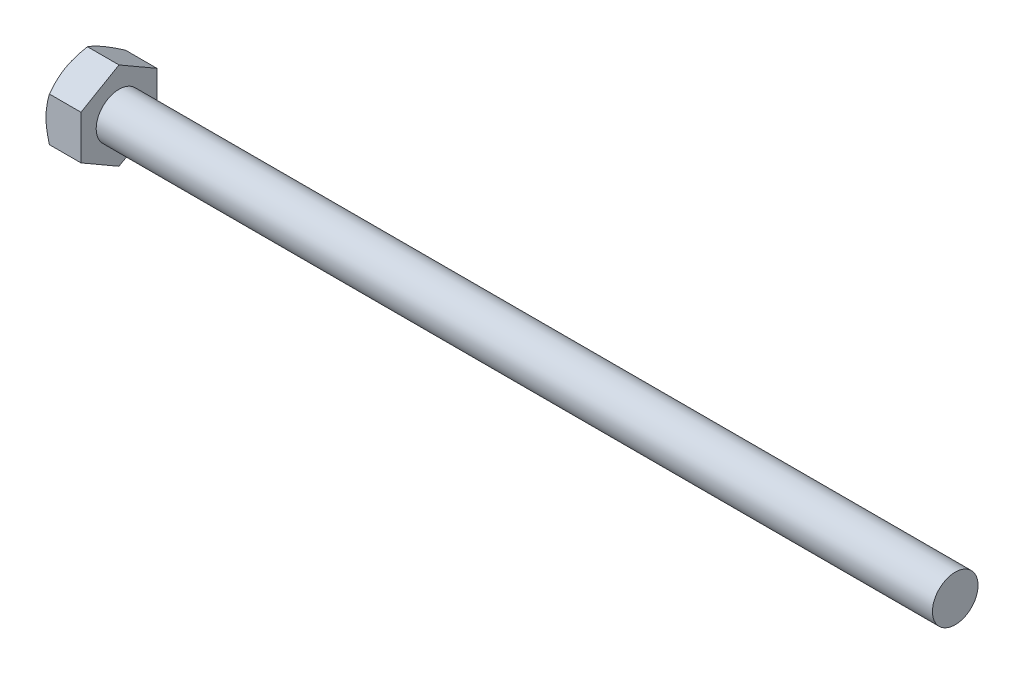
ISO-10303-21;
HEADER;
FILE_DESCRIPTION(('STEP AP214'),'2;1');
FILE_NAME('part.step','',(''),(''),'','','');
FILE_SCHEMA(('AUTOMOTIVE_DESIGN { 1 0 10303 214 1 1 1 1 }'));
ENDSEC;
DATA;
#1=APPLICATION_CONTEXT('core data for automotive mechanical design processes');
#2=APPLICATION_PROTOCOL_DEFINITION('international standard','automotive_design',2000,#1);
#3=PRODUCT_CONTEXT('',#1,'mechanical');
#4=PRODUCT('Part','Part','',(#3));
#5=PRODUCT_RELATED_PRODUCT_CATEGORY('part','',(#4));
#6=PRODUCT_DEFINITION_FORMATION('','',#4);
#7=PRODUCT_DEFINITION_CONTEXT('part definition',#1,'design');
#8=PRODUCT_DEFINITION('design','',#6,#7);
#9=PRODUCT_DEFINITION_SHAPE('','',#8);
#10=(LENGTH_UNIT() NAMED_UNIT(*) SI_UNIT(.MILLI.,.METRE.));
#11=(NAMED_UNIT(*) PLANE_ANGLE_UNIT() SI_UNIT($,.RADIAN.));
#12=(NAMED_UNIT(*) SI_UNIT($,.STERADIAN.) SOLID_ANGLE_UNIT());
#13=UNCERTAINTY_MEASURE_WITH_UNIT(LENGTH_MEASURE(1.E-05),#10,'distance_accuracy_value','');
#14=(GEOMETRIC_REPRESENTATION_CONTEXT(3) GLOBAL_UNCERTAINTY_ASSIGNED_CONTEXT((#13)) GLOBAL_UNIT_ASSIGNED_CONTEXT((#10,
#11,#12)) REPRESENTATION_CONTEXT('',''));
#15=CARTESIAN_POINT('',(0.,0.,0.));
#16=DIRECTION('',(0.,0.,1.));
#17=DIRECTION('',(1.,0.,0.));
#18=AXIS2_PLACEMENT_3D('',#15,#16,#17);
#19=CARTESIAN_POINT('',(2.3,1.5,0.));
#20=DIRECTION('',(-1.,0.,0.));
#21=DIRECTION('',(0.,0.,1.));
#22=AXIS2_PLACEMENT_3D('',#19,#20,#21);
#23=PLANE('',#22);
#24=CARTESIAN_POINT('',(2.3,0.,0.));
#25=DIRECTION('',(-1.,0.,0.));
#26=DIRECTION('',(0.,0.,1.));
#27=AXIS2_PLACEMENT_3D('',#24,#25,#26);
#28=CIRCLE('',#27,1.5);
#29=CARTESIAN_POINT('',(2.3,0.,1.5));
#30=VERTEX_POINT('',#29);
#31=EDGE_CURVE('E200',#30,#30,#28,.T.);
#32=ORIENTED_EDGE('',*,*,#31,.T.);
#33=EDGE_LOOP('',(#32));
#34=FACE_BOUND('',#33,.T.);
#35=DIRECTION('',(0.,1.,0.));
#36=VECTOR('',#35,1.);
#37=CARTESIAN_POINT('',(2.3,-1.44337567928133,2.5));
#38=LINE('',#37,#36);
#39=CARTESIAN_POINT('',(2.3,-1.44337567928133,2.5));
#40=VERTEX_POINT('',#39);
#41=CARTESIAN_POINT('',(2.3,1.44337567928159,2.5));
#42=VERTEX_POINT('',#41);
#43=EDGE_CURVE('E60',#40,#42,#38,.T.);
#44=ORIENTED_EDGE('',*,*,#43,.F.);
#45=DIRECTION('',(0.,0.50000000163871,0.866025402838329));
#46=VECTOR('',#45,1.);
#47=CARTESIAN_POINT('',(2.3,-2.8867513585628,0.));
#48=LINE('',#47,#46);
#49=CARTESIAN_POINT('',(2.3,-2.8867513585628,0.));
#50=VERTEX_POINT('',#49);
#51=EDGE_CURVE('E133',#50,#40,#48,.T.);
#52=ORIENTED_EDGE('',*,*,#51,.F.);
#53=DIRECTION('',(0.,-0.50000000163871,0.866025402838329));
#54=VECTOR('',#53,1.);
#55=CARTESIAN_POINT('',(2.3,-1.44337567928133,-2.5));
#56=LINE('',#55,#54);
#57=CARTESIAN_POINT('',(2.3,-1.44337567928133,-2.5));
#58=VERTEX_POINT('',#57);
#59=EDGE_CURVE('E131',#58,#50,#56,.T.);
#60=ORIENTED_EDGE('',*,*,#59,.F.);
#61=DIRECTION('',(0.,-1.,0.));
#62=VECTOR('',#61,1.);
#63=CARTESIAN_POINT('',(2.3,1.44337567928159,-2.5));
#64=LINE('',#63,#62);
#65=CARTESIAN_POINT('',(2.3,1.44337567928159,-2.5));
#66=VERTEX_POINT('',#65);
#67=EDGE_CURVE('E114',#66,#58,#64,.T.);
#68=ORIENTED_EDGE('',*,*,#67,.F.);
#69=DIRECTION('',(0.,-0.50000000163871,-0.866025402838329));
#70=VECTOR('',#69,1.);
#71=CARTESIAN_POINT('',(2.3,2.88675135856305,0.));
#72=LINE('',#71,#70);
#73=CARTESIAN_POINT('',(2.3,2.88675135856305,0.));
#74=VERTEX_POINT('',#73);
#75=EDGE_CURVE('E123',#74,#66,#72,.T.);
#76=ORIENTED_EDGE('',*,*,#75,.F.);
#77=DIRECTION('',(0.,0.50000000163871,-0.866025402838329));
#78=VECTOR('',#77,1.);
#79=CARTESIAN_POINT('',(2.3,1.44337567928159,2.5));
#80=LINE('',#79,#78);
#81=EDGE_CURVE('E127',#42,#74,#80,.T.);
#82=ORIENTED_EDGE('',*,*,#81,.F.);
#83=EDGE_LOOP('',(#44,#52,#60,#68,#76,#82));
#84=FACE_BOUND('',#83,.T.);
#85=ADVANCED_FACE('F37',(#34,#84),#23,.F.);
#86=CARTESIAN_POINT('',(-25.4,0.,0.));
#87=DIRECTION('',(-1.,0.,0.));
#88=DIRECTION('',(0.,0.,1.));
#89=AXIS2_PLACEMENT_3D('',#86,#87,#88);
#90=CYLINDRICAL_SURFACE('',#89,1.5);
#91=CARTESIAN_POINT('',(57.3,0.,0.));
#92=DIRECTION('',(-1.,0.,0.));
#93=DIRECTION('',(0.,0.,1.));
#94=AXIS2_PLACEMENT_3D('',#91,#92,#93);
#95=CIRCLE('',#94,1.5);
#96=CARTESIAN_POINT('',(57.3,0.,1.5));
#97=VERTEX_POINT('',#96);
#98=EDGE_CURVE('E11',#97,#97,#95,.T.);
#99=ORIENTED_EDGE('',*,*,#98,.T.);
#100=EDGE_LOOP('',(#99));
#101=FACE_BOUND('',#100,.T.);
#102=ORIENTED_EDGE('',*,*,#31,.F.);
#103=EDGE_LOOP('',(#102));
#104=FACE_BOUND('',#103,.T.);
#105=ADVANCED_FACE('F39',(#101,#104),#90,.T.);
#106=CARTESIAN_POINT('',(57.3,1.5,0.));
#107=DIRECTION('',(1.,0.,0.));
#108=DIRECTION('',(0.,0.,-1.));
#109=AXIS2_PLACEMENT_3D('',#106,#107,#108);
#110=PLANE('',#109);
#111=ORIENTED_EDGE('',*,*,#98,.F.);
#112=EDGE_LOOP('',(#111));
#113=FACE_BOUND('',#112,.T.);
#114=ADVANCED_FACE('F181',(#113),#110,.T.);
#115=CARTESIAN_POINT('',(2.3,-1.44337567928133,2.5));
#116=DIRECTION('',(0.,0.,1.));
#117=DIRECTION('',(0.,-1.,0.));
#118=AXIS2_PLACEMENT_3D('',#115,#116,#117);
#119=PLANE('',#118);
#120=DIRECTION('',(-1.,0.,0.));
#121=VECTOR('',#120,1.);
#122=CARTESIAN_POINT('',(2.3,-1.44337567928133,2.5));
#123=LINE('',#122,#121);
#124=CARTESIAN_POINT('',(0.223290995513354,-1.44337567928133,2.5));
#125=VERTEX_POINT('',#124);
#126=EDGE_CURVE('E140',#40,#125,#123,.T.);
#127=ORIENTED_EDGE('',*,*,#126,.F.);
#128=ORIENTED_EDGE('',*,*,#43,.T.);
#129=DIRECTION('',(-1.,0.,0.));
#130=VECTOR('',#129,1.);
#131=CARTESIAN_POINT('',(2.3,1.44337567928159,2.5));
#132=LINE('',#131,#130);
#133=CARTESIAN_POINT('',(0.223290995513429,1.44337567928159,2.5));
#134=VERTEX_POINT('',#133);
#135=EDGE_CURVE('E139',#42,#134,#132,.T.);
#136=ORIENTED_EDGE('',*,*,#135,.T.);
#137=CARTESIAN_POINT('',(1.19632004406595,-3.82805178069449,2.5));
#138=CARTESIAN_POINT('',(1.14327589629636,-3.7182875906123,2.5));
#139=CARTESIAN_POINT('',(1.09075904917703,-3.60826388251005,2.5));
#140=CARTESIAN_POINT('',(0.987081273872628,-3.38755710903453,2.5));
#141=CARTESIAN_POINT('',(0.935920580448254,-3.27687393351173,2.5));
#142=CARTESIAN_POINT('',(0.834986914311904,-3.05411000573681,2.5));
#143=CARTESIAN_POINT('',(0.785223558317014,-2.94202488038616,2.5));
#144=CARTESIAN_POINT('',(0.687834293242499,-2.71693339089507,2.5));
#145=CARTESIAN_POINT('',(0.64020827274816,-2.60392707513802,2.5));
#146=CARTESIAN_POINT('',(0.547096599216495,-2.37541055612811,2.5));
#147=CARTESIAN_POINT('',(0.501644402476205,-2.25988664554279,2.5));
#148=CARTESIAN_POINT('',(0.414299798759198,-2.02747621227372,2.5));
#149=CARTESIAN_POINT('',(0.372407787833691,-1.91058953963062,2.5));
#150=CARTESIAN_POINT('',(0.293309177636011,-1.67550769213624,2.5));
#151=CARTESIAN_POINT('',(0.25609261725792,-1.55731590352552,2.5));
#152=CARTESIAN_POINT('',(0.187553577101156,-1.31925207497197,2.5));
#153=CARTESIAN_POINT('',(0.156229233411223,-1.19938057931484,2.5));
#154=CARTESIAN_POINT('',(0.100995335359192,-0.957875466950475,2.5));
#155=CARTESIAN_POINT('',(0.0770877549190804,-0.836241390144261,2.5));
#156=CARTESIAN_POINT('',(0.0382970673549973,-0.591506739851933,2.5));
#157=CARTESIAN_POINT('',(0.0234139682023207,-0.468406165070562,2.5));
#158=CARTESIAN_POINT('',(0.00398887707067176,-0.222162283708564,2.5));
#159=CARTESIAN_POINT('',(-0.000618582954530851,-0.0990242760150258,2.5));
#160=CARTESIAN_POINT('',(0.000752385125691248,0.147165525321938,2.5));
#161=CARTESIAN_POINT('',(0.00672806531326748,0.270217333048273,2.5));
#162=CARTESIAN_POINT('',(0.0255487226845901,0.480345911839685,2.5));
#163=CARTESIAN_POINT('',(0.0359427194182765,0.567654504214298,2.5));
#164=CARTESIAN_POINT('',(0.0613825749513618,0.741597260879313,2.5));
#165=CARTESIAN_POINT('',(0.0764291673933814,0.828231316595431,2.5));
#166=CARTESIAN_POINT('',(0.127758160854863,1.0870510539617,2.5));
#167=CARTESIAN_POINT('',(0.170216562336702,1.258023566365,2.5));
#168=CARTESIAN_POINT('',(0.243445888381077,1.51385794210056,2.5));
#169=CARTESIAN_POINT('',(0.269819264012639,1.60005333907683,2.5));
#170=CARTESIAN_POINT('',(0.325175689355996,1.7715444847852,2.5));
#171=CARTESIAN_POINT('',(0.354156939094442,1.8568408093229,2.5));
#172=CARTESIAN_POINT('',(0.414126062328043,2.02617712827433,2.5));
#173=CARTESIAN_POINT('',(0.445101723039576,2.11022149180121,2.5));
#174=CARTESIAN_POINT('',(0.508871156887617,2.27765814571535,2.5));
#175=CARTESIAN_POINT('',(0.541665664837585,2.36105015679791,2.5));
#176=CARTESIAN_POINT('',(0.575190110848553,2.44414064056434,2.5));
#177=B_SPLINE_CURVE_WITH_KNOTS('',3,(#137,#138,#139,#140,#141,#142,#143,#144,#145,#146,#147,
#148,#149,#150,#151,#152,#153,#154,#155,#156,#157,#158,#159,#160,#161,#162,#163,#164,#165,#166,
#167,#168,#169,#170,#171,#172,#173,#174,#175,#176),.UNSPECIFIED.,.F.,.F.,(4,2,2,2,2,2,2,2,2,2,2,
2,2,2,2,2,2,2,2,4),(0.,0.365732583178816,0.731528069426235,1.0994168436567,1.46728641830588,
1.83967239293614,2.21209973939173,2.58371966044213,2.95522182687511,3.32682278147237,
3.69842406430308,4.06765095845392,4.43678199670504,4.70042859172476,4.96411678096691,
5.49188560395094,5.76228383952689,6.03249685521827,6.30118893346184,6.56999036530353),.UNSPECIFIED.);
#178=CARTESIAN_POINT('',(0.,0.,2.5));
#179=VERTEX_POINT('',#178);
#180=EDGE_CURVE('E183',#179,#134,#177,.T.);
#181=ORIENTED_EDGE('',*,*,#180,.F.);
#182=EDGE_CURVE('E191',#125,#179,#177,.T.);
#183=ORIENTED_EDGE('',*,*,#182,.F.);
#184=EDGE_LOOP('',(#127,#128,#136,#181,#183));
#185=FACE_BOUND('',#184,.T.);
#186=ADVANCED_FACE('F177',(#185),#119,.T.);
#187=CARTESIAN_POINT('',(2.3,-2.8867513585628,0.));
#188=DIRECTION('',(0.,-0.866025402838329,0.500000001638711));
#189=DIRECTION('',(0.,-0.500000001638711,-0.866025402838329));
#190=AXIS2_PLACEMENT_3D('',#187,#188,#189);
#191=PLANE('',#190);
#192=DIRECTION('',(-1.,0.,0.));
#193=VECTOR('',#192,1.);
#194=CARTESIAN_POINT('',(2.3,-2.8867513585628,0.));
#195=LINE('',#194,#193);
#196=CARTESIAN_POINT('',(0.223291000975683,-2.8867513585628,0.));
#197=VERTEX_POINT('',#196);
#198=EDGE_CURVE('E144',#50,#197,#195,.T.);
#199=ORIENTED_EDGE('',*,*,#198,.F.);
#200=ORIENTED_EDGE('',*,*,#51,.T.);
#201=ORIENTED_EDGE('',*,*,#126,.T.);
#202=CARTESIAN_POINT('',(0.223357671642481,-2.88686682861714,-0.000199999999997055));
#203=CARTESIAN_POINT('',(0.186721627123144,-2.823437260003,0.109663235061774));
#204=CARTESIAN_POINT('',(0.153402225713998,-2.75946017255779,0.220474800552927));
#205=CARTESIAN_POINT('',(0.0952422917887059,-2.63039811834957,0.444016834793913));
#206=CARTESIAN_POINT('',(0.0704223351272887,-2.5653108579734,0.556751276198274));
#207=CARTESIAN_POINT('',(0.0317856569546165,-2.43594298952786,0.780822996233662));
#208=CARTESIAN_POINT('',(0.0177118014837245,-2.37168228872263,0.892125794471919));
#209=CARTESIAN_POINT('',(0.000909157269638142,-2.24285844798616,1.1152552308786));
#210=CARTESIAN_POINT('',(-0.0018335440453357,-2.17829577643781,1.22708105778404));
#211=CARTESIAN_POINT('',(0.00386576449219316,-2.05765213161006,1.43604197932287));
#212=CARTESIAN_POINT('',(0.0109083986955485,-2.00155311785805,1.53320832097125));
#213=CARTESIAN_POINT('',(0.0332314230427739,-1.88972058300822,1.72690795242393));
#214=CARTESIAN_POINT('',(0.0485194421325141,-1.83398744884957,1.82344057202992));
#215=CARTESIAN_POINT('',(0.0867390970453044,-1.7219242510559,2.01753972341901));
#216=CARTESIAN_POINT('',(0.109832779058663,-1.66560837412358,2.11508168311234));
#217=CARTESIAN_POINT('',(0.162246658960904,-1.55381666130744,2.3087106087289));
#218=CARTESIAN_POINT('',(0.191554537725398,-1.49833939269559,2.40480005620986));
#219=CARTESIAN_POINT('',(0.223357666179496,-1.44326020922699,2.5002));
#220=B_SPLINE_CURVE_WITH_KNOTS('',3,(#202,#203,#204,#205,#206,#207,#208,#209,#210,#211,#212,
#213,#214,#215,#216,#217,#218,#219),.UNSPECIFIED.,.F.,.F.,(4,2,2,2,2,2,2,2,4),(0.,
0.396285829073731,0.793524333587547,1.18093087363639,1.56786160813528,1.90479742383017,
2.24204552159359,2.58677531937551,2.93082800409491),.UNSPECIFIED.);
#221=CARTESIAN_POINT('',(0.,-2.16506351419155,1.2500000081935));
#222=VERTEX_POINT('',#221);
#223=EDGE_CURVE('E193',#222,#125,#220,.T.);
#224=ORIENTED_EDGE('',*,*,#223,.F.);
#225=EDGE_CURVE('E192',#197,#222,#220,.T.);
#226=ORIENTED_EDGE('',*,*,#225,.F.);
#227=EDGE_LOOP('',(#199,#200,#201,#224,#226));
#228=FACE_BOUND('',#227,.T.);
#229=ADVANCED_FACE('F180',(#228),#191,.T.);
#230=CARTESIAN_POINT('',(2.3,-1.44337567928133,-2.5));
#231=DIRECTION('',(0.,-0.866025402838329,-0.50000000163871));
#232=DIRECTION('',(0.,0.50000000163871,-0.866025402838329));
#233=AXIS2_PLACEMENT_3D('',#230,#231,#232);
#234=PLANE('',#233);
#235=DIRECTION('',(-1.,0.,0.));
#236=VECTOR('',#235,1.);
#237=CARTESIAN_POINT('',(2.3,-1.44337567928133,-2.5));
#238=LINE('',#237,#236);
#239=CARTESIAN_POINT('',(0.223290995513354,-1.44337567928133,-2.5));
#240=VERTEX_POINT('',#239);
#241=EDGE_CURVE('E120',#58,#240,#238,.T.);
#242=ORIENTED_EDGE('',*,*,#241,.F.);
#243=ORIENTED_EDGE('',*,*,#59,.T.);
#244=ORIENTED_EDGE('',*,*,#198,.T.);
#245=CARTESIAN_POINT('',(0.223357666179496,-1.44326020922699,-2.5002));
#246=CARTESIAN_POINT('',(0.186721622105297,-1.5066897776876,-2.39033676520415));
#247=CARTESIAN_POINT('',(0.153402221169772,-1.57066686497833,-2.27952519998057));
#248=CARTESIAN_POINT('',(0.0952422882291764,-1.69972891886277,-2.05598316630038));
#249=CARTESIAN_POINT('',(0.0704223320783219,-1.76481617906955,-1.94324872518942));
#250=CARTESIAN_POINT('',(0.0317856549217424,-1.89418404716996,-1.71917700575181));
#251=CARTESIAN_POINT('',(0.0177117999573057,-1.95844474779998,-1.60787420781702));
#252=CARTESIAN_POINT('',(0.00090915671970467,-2.08726858816535,-1.38474477205312));
#253=CARTESIAN_POINT('',(-0.00183354412493002,-2.15183125951782,-1.27291894548693));
#254=CARTESIAN_POINT('',(0.00386576523131279,-2.27247490433789,-1.0639580239614));
#255=CARTESIAN_POINT('',(0.0109083998520694,-2.3285739182796,-0.966791681984465));
#256=CARTESIAN_POINT('',(0.0332314250552663,-2.44040645349358,-0.773092049901063));
#257=CARTESIAN_POINT('',(0.048519444583664,-2.49613958782666,-0.676559429992934));
#258=CARTESIAN_POINT('',(0.0867391003778061,-2.60820278596567,-0.48246027800571));
#259=CARTESIAN_POINT('',(0.109832782834311,-2.66451866306856,-0.384918318016938));
#260=CARTESIAN_POINT('',(0.162246663600414,-2.77631037621612,-0.191289391826346));
#261=CARTESIAN_POINT('',(0.19155454278545,-2.83178764498885,-0.0951999440667246));
#262=CARTESIAN_POINT('',(0.223357671642481,-2.88686682861714,0.000200000000003285));
#263=B_SPLINE_CURVE_WITH_KNOTS('',3,(#245,#246,#247,#248,#249,#250,#251,#252,#253,#254,#255,
#256,#257,#258,#259,#260,#261,#262),.UNSPECIFIED.,.F.,.F.,(4,2,2,2,2,2,2,2,4),(0.,
0.396285827816312,0.793524331042151,1.18093086988015,1.56786160317875,1.90479742008592,
2.24204551906553,2.58677531811864,2.9308280040949),.UNSPECIFIED.);
#264=CARTESIAN_POINT('',(0.,-2.16506351419155,-1.25000000819349));
#265=VERTEX_POINT('',#264);
#266=EDGE_CURVE('E223',#265,#197,#263,.T.);
#267=ORIENTED_EDGE('',*,*,#266,.F.);
#268=EDGE_CURVE('E228',#240,#265,#263,.T.);
#269=ORIENTED_EDGE('',*,*,#268,.F.);
#270=EDGE_LOOP('',(#242,#243,#244,#267,#269));
#271=FACE_BOUND('',#270,.T.);
#272=ADVANCED_FACE('F299',(#271),#234,.T.);
#273=CARTESIAN_POINT('',(2.3,1.44337567928159,-2.5));
#274=DIRECTION('',(0.,0.,-1.));
#275=DIRECTION('',(0.,1.,0.));
#276=AXIS2_PLACEMENT_3D('',#273,#274,#275);
#277=PLANE('',#276);
#278=DIRECTION('',(-1.,0.,0.));
#279=VECTOR('',#278,1.);
#280=CARTESIAN_POINT('',(2.3,1.44337567928159,-2.5));
#281=LINE('',#280,#279);
#282=CARTESIAN_POINT('',(0.223290995513426,1.44337567928159,-2.5));
#283=VERTEX_POINT('',#282);
#284=EDGE_CURVE('E109',#66,#283,#281,.T.);
#285=ORIENTED_EDGE('',*,*,#284,.F.);
#286=ORIENTED_EDGE('',*,*,#67,.T.);
#287=ORIENTED_EDGE('',*,*,#241,.T.);
#288=CARTESIAN_POINT('',(1.19632004406595,-3.82805178069449,-2.5));
#289=CARTESIAN_POINT('',(1.14327589629636,-3.71828759061229,-2.5));
#290=CARTESIAN_POINT('',(1.09075904917703,-3.60826388251005,-2.5));
#291=CARTESIAN_POINT('',(0.987081273872629,-3.38755710903453,-2.5));
#292=CARTESIAN_POINT('',(0.935920580448254,-3.27687393351173,-2.5));
#293=CARTESIAN_POINT('',(0.834986914311905,-3.05411000573681,-2.5));
#294=CARTESIAN_POINT('',(0.785223558317014,-2.94202488038616,-2.5));
#295=CARTESIAN_POINT('',(0.687834293242499,-2.71693339089507,-2.5));
#296=CARTESIAN_POINT('',(0.64020827274816,-2.60392707513802,-2.5));
#297=CARTESIAN_POINT('',(0.547096599216495,-2.3754105561281,-2.5));
#298=CARTESIAN_POINT('',(0.501644402476205,-2.25988664554279,-2.5));
#299=CARTESIAN_POINT('',(0.414299798759198,-2.02747621227372,-2.5));
#300=CARTESIAN_POINT('',(0.372407787833692,-1.91058953963062,-2.5));
#301=CARTESIAN_POINT('',(0.293309177636011,-1.67550769213624,-2.5));
#302=CARTESIAN_POINT('',(0.25609261725792,-1.55731590352552,-2.5));
#303=CARTESIAN_POINT('',(0.187553577101155,-1.31925207497197,-2.5));
#304=CARTESIAN_POINT('',(0.156229233411223,-1.19938057931484,-2.5));
#305=CARTESIAN_POINT('',(0.100995335359191,-0.957875466950474,-2.5));
#306=CARTESIAN_POINT('',(0.0770877549190793,-0.836241390144261,-2.5));
#307=CARTESIAN_POINT('',(0.0382970673549961,-0.591506739851933,-2.5));
#308=CARTESIAN_POINT('',(0.0234139682023195,-0.468406165070563,-2.5));
#309=CARTESIAN_POINT('',(0.00398887707067026,-0.222162283708564,-2.5));
#310=CARTESIAN_POINT('',(-0.000618582954532723,-0.099024276015026,-2.5));
#311=CARTESIAN_POINT('',(0.000752385125689055,0.147165525321938,-2.5));
#312=CARTESIAN_POINT('',(0.00672806531326533,0.270217333048273,-2.5));
#313=CARTESIAN_POINT('',(0.0255487226845878,0.480345911839685,-2.5));
#314=CARTESIAN_POINT('',(0.0359427194182741,0.567654504214298,-2.5));
#315=CARTESIAN_POINT('',(0.0613825749513591,0.741597260879313,-2.5));
#316=CARTESIAN_POINT('',(0.0764291673933784,0.82823131659543,-2.5));
#317=CARTESIAN_POINT('',(0.127758160854859,1.0870510539617,-2.5));
#318=CARTESIAN_POINT('',(0.170216562336698,1.25802356636499,-2.5));
#319=CARTESIAN_POINT('',(0.243445888381073,1.51385794210056,-2.5));
#320=CARTESIAN_POINT('',(0.269819264012635,1.60005333907683,-2.5));
#321=CARTESIAN_POINT('',(0.325175689355992,1.77154448478519,-2.5));
#322=CARTESIAN_POINT('',(0.354156939094438,1.85684080932289,-2.5));
#323=CARTESIAN_POINT('',(0.414126062328038,2.02617712827432,-2.5));
#324=CARTESIAN_POINT('',(0.445101723039571,2.1102214918012,-2.5));
#325=CARTESIAN_POINT('',(0.508871156887612,2.27765814571535,-2.5));
#326=CARTESIAN_POINT('',(0.541665664837579,2.36105015679791,-2.5));
#327=CARTESIAN_POINT('',(0.575190110848547,2.44414064056433,-2.5));
#328=B_SPLINE_CURVE_WITH_KNOTS('',3,(#288,#289,#290,#291,#292,#293,#294,#295,#296,#297,#298,
#299,#300,#301,#302,#303,#304,#305,#306,#307,#308,#309,#310,#311,#312,#313,#314,#315,#316,#317,
#318,#319,#320,#321,#322,#323,#324,#325,#326,#327),.UNSPECIFIED.,.F.,.F.,(4,2,2,2,2,2,2,2,2,2,2,
2,2,2,2,2,2,2,2,4),(0.,0.365732583178816,0.731528069426236,1.0994168436567,1.46728641830589,
1.83967239293614,2.21209973939173,2.58371966044213,2.95522182687511,3.32682278147237,
3.69842406430308,4.06765095845392,4.43678199670504,4.70042859172476,4.96411678096691,
5.49188560395093,5.76228383952689,6.03249685521826,6.30118893346183,6.56999036530352),.UNSPECIFIED.);
#329=CARTESIAN_POINT('',(0.,0.,-2.5));
#330=VERTEX_POINT('',#329);
#331=EDGE_CURVE('E224',#330,#240,#328,.F.);
#332=ORIENTED_EDGE('',*,*,#331,.F.);
#333=EDGE_CURVE('E117',#283,#330,#328,.F.);
#334=ORIENTED_EDGE('',*,*,#333,.F.);
#335=EDGE_LOOP('',(#285,#286,#287,#332,#334));
#336=FACE_BOUND('',#335,.T.);
#337=ADVANCED_FACE('F111',(#336),#277,.T.);
#338=CARTESIAN_POINT('',(2.3,2.88675135856305,0.));
#339=DIRECTION('',(0.,0.866025402838329,-0.50000000163871));
#340=DIRECTION('',(0.,0.50000000163871,0.866025402838329));
#341=AXIS2_PLACEMENT_3D('',#338,#339,#340);
#342=PLANE('',#341);
#343=DIRECTION('',(-1.,0.,0.));
#344=VECTOR('',#343,1.);
#345=CARTESIAN_POINT('',(2.3,2.88675135856305,0.));
#346=LINE('',#345,#344);
#347=CARTESIAN_POINT('',(0.223291000975831,2.88675135856305,0.));
#348=VERTEX_POINT('',#347);
#349=EDGE_CURVE('E52',#74,#348,#346,.T.);
#350=ORIENTED_EDGE('',*,*,#349,.F.);
#351=ORIENTED_EDGE('',*,*,#75,.T.);
#352=ORIENTED_EDGE('',*,*,#284,.T.);
#353=CARTESIAN_POINT('',(0.223357671642628,2.88686682861739,0.000200000000002865));
#354=CARTESIAN_POINT('',(0.186721627123289,2.82343726000325,-0.109663235061778));
#355=CARTESIAN_POINT('',(0.15340222571414,2.75946017255803,-0.22047480055294));
#356=CARTESIAN_POINT('',(0.0952422917888422,2.6303981183498,-0.444016834793946));
#357=CARTESIAN_POINT('',(0.0704223351274228,2.56531085797362,-0.556751276198317));
#358=CARTESIAN_POINT('',(0.0317856569547468,2.43594298952807,-0.780822996233725));
#359=CARTESIAN_POINT('',(0.0177118014838533,2.37168228872284,-0.892125794471992));
#360=CARTESIAN_POINT('',(0.000909157269765117,2.24285844798636,-1.11525523087869));
#361=CARTESIAN_POINT('',(-0.00183354404520911,2.17829577643801,-1.22708105778415));
#362=CARTESIAN_POINT('',(0.00386576449231955,2.05765213161025,-1.43604197932297));
#363=CARTESIAN_POINT('',(0.0109083986956732,2.00155311785825,-1.53320832097134));
#364=CARTESIAN_POINT('',(0.033231423042893,1.88972058300843,-1.726907952424));
#365=CARTESIAN_POINT('',(0.0485194421326293,1.83398744884979,-1.82344057202999));
#366=CARTESIAN_POINT('',(0.0867390970454098,1.72192425105612,-2.01753972341906));
#367=CARTESIAN_POINT('',(0.109832779058763,1.66560837412381,-2.11508168311237));
#368=CARTESIAN_POINT('',(0.16224665896099,1.55381666130769,-2.30871060872891));
#369=CARTESIAN_POINT('',(0.191554537725478,1.49833939269584,-2.40480005620987));
#370=CARTESIAN_POINT('',(0.223357666179568,1.44326020922725,-2.5002));
#371=B_SPLINE_CURVE_WITH_KNOTS('',3,(#353,#354,#355,#356,#357,#358,#359,#360,#361,#362,#363,
#364,#365,#366,#367,#368,#369,#370),.UNSPECIFIED.,.F.,.F.,(4,2,2,2,2,2,2,2,4),(0.,
0.396285829073766,0.793524333587617,1.1809308736365,1.56786160813542,1.90479742383028,
2.24204552159366,2.58677531937554,2.93082800409491),.UNSPECIFIED.);
#372=CARTESIAN_POINT('',(0.,2.16506351419174,-1.2500000081936));
#373=VERTEX_POINT('',#372);
#374=EDGE_CURVE('E159',#373,#283,#371,.T.);
#375=ORIENTED_EDGE('',*,*,#374,.F.);
#376=EDGE_CURVE('E287',#348,#373,#371,.T.);
#377=ORIENTED_EDGE('',*,*,#376,.F.);
#378=EDGE_LOOP('',(#350,#351,#352,#375,#377));
#379=FACE_BOUND('',#378,.T.);
#380=ADVANCED_FACE('F124',(#379),#342,.T.);
#381=CARTESIAN_POINT('',(2.3,1.44337567928159,2.5));
#382=DIRECTION('',(0.,0.866025402838329,0.50000000163871));
#383=DIRECTION('',(0.,-0.50000000163871,0.866025402838329));
#384=AXIS2_PLACEMENT_3D('',#381,#382,#383);
#385=PLANE('',#384);
#386=ORIENTED_EDGE('',*,*,#135,.F.);
#387=ORIENTED_EDGE('',*,*,#81,.T.);
#388=ORIENTED_EDGE('',*,*,#349,.T.);
#389=CARTESIAN_POINT('',(0.223357666179571,1.44326020922725,2.5002));
#390=CARTESIAN_POINT('',(0.186721622105376,1.50668977768786,2.39033676520415));
#391=CARTESIAN_POINT('',(0.153402221169854,1.57066686497859,2.27952519998056));
#392=CARTESIAN_POINT('',(0.0952422882292661,1.69972891886304,2.05598316630036));
#393=CARTESIAN_POINT('',(0.0704223320784162,1.76481617906983,1.94324872518939));
#394=CARTESIAN_POINT('',(0.0317856549218469,1.89418404717024,1.71917700575177));
#395=CARTESIAN_POINT('',(0.0177117999574159,1.95844474780027,1.60787420781697));
#396=CARTESIAN_POINT('',(0.000909156719826574,2.08726858816564,1.38474477205306));
#397=CARTESIAN_POINT('',(-0.00183354412480209,2.15183125951811,1.27291894548687));
#398=CARTESIAN_POINT('',(0.00386576523145182,2.27247490433819,1.06395802396134));
#399=CARTESIAN_POINT('',(0.0109083998522126,2.32857391827989,0.966791681984408));
#400=CARTESIAN_POINT('',(0.0332314250554153,2.44040645349386,0.773092049901018));
#401=CARTESIAN_POINT('',(0.0485194445838148,2.49613958782694,0.676559429992895));
#402=CARTESIAN_POINT('',(0.0867391003779589,2.60820278596594,0.482460278005685));
#403=CARTESIAN_POINT('',(0.109832782834464,2.66451866306883,0.38491831801692));
#404=CARTESIAN_POINT('',(0.162246663600566,2.77631037621638,0.19128939182634));
#405=CARTESIAN_POINT('',(0.1915545427856,2.83178764498911,0.095199944066725));
#406=CARTESIAN_POINT('',(0.223357671642629,2.88686682861739,-0.000199999999997085));
#407=B_SPLINE_CURVE_WITH_KNOTS('',3,(#389,#390,#391,#392,#393,#394,#395,#396,#397,#398,#399,
#400,#401,#402,#403,#404,#405,#406),.UNSPECIFIED.,.F.,.F.,(4,2,2,2,2,2,2,2,4),(0.,
0.396285827816331,0.793524331042187,1.1809308698802,1.56786160317882,1.90479742008597,
2.24204551906556,2.58677531811865,2.93082800409489),.UNSPECIFIED.);
#408=CARTESIAN_POINT('',(0.,2.16506351419174,1.25000000819361));
#409=VERTEX_POINT('',#408);
#410=EDGE_CURVE('E143',#409,#348,#407,.T.);
#411=ORIENTED_EDGE('',*,*,#410,.F.);
#412=EDGE_CURVE('E158',#134,#409,#407,.T.);
#413=ORIENTED_EDGE('',*,*,#412,.F.);
#414=EDGE_LOOP('',(#386,#387,#388,#411,#413));
#415=FACE_BOUND('',#414,.T.);
#416=ADVANCED_FACE('F170',(#415),#385,.T.);
#417=CARTESIAN_POINT('',(0.,0.,0.));
#418=DIRECTION('',(1.,0.,0.));
#419=DIRECTION('',(0.,0.,-1.));
#420=AXIS2_PLACEMENT_3D('',#417,#418,#419);
#421=CONICAL_SURFACE('',#420,2.5,1.0471975511966);
#422=CARTESIAN_POINT('',(0.,0.,0.));
#423=DIRECTION('',(-1.,0.,0.));
#424=DIRECTION('',(0.,0.,1.));
#425=AXIS2_PLACEMENT_3D('',#422,#423,#424);
#426=CIRCLE('',#425,2.5);
#427=EDGE_CURVE('E202',#222,#179,#426,.T.);
#428=ORIENTED_EDGE('',*,*,#427,.F.);
#429=ORIENTED_EDGE('',*,*,#223,.T.);
#430=ORIENTED_EDGE('',*,*,#182,.T.);
#431=EDGE_LOOP('',(#428,#429,#430));
#432=FACE_BOUND('',#431,.T.);
#433=ADVANCED_FACE('F174',(#432),#421,.T.);
#434=EDGE_CURVE('E210',#265,#222,#426,.T.);
#435=ORIENTED_EDGE('',*,*,#434,.F.);
#436=ORIENTED_EDGE('',*,*,#266,.T.);
#437=ORIENTED_EDGE('',*,*,#225,.T.);
#438=EDGE_LOOP('',(#435,#436,#437));
#439=FACE_BOUND('',#438,.T.);
#440=ADVANCED_FACE('F233',(#439),#421,.T.);
#441=ORIENTED_EDGE('',*,*,#331,.T.);
#442=ORIENTED_EDGE('',*,*,#268,.T.);
#443=EDGE_CURVE('E213',#330,#265,#426,.T.);
#444=ORIENTED_EDGE('',*,*,#443,.F.);
#445=EDGE_LOOP('',(#441,#442,#444));
#446=FACE_BOUND('',#445,.T.);
#447=ADVANCED_FACE('F166',(#446),#421,.T.);
#448=ORIENTED_EDGE('',*,*,#374,.T.);
#449=ORIENTED_EDGE('',*,*,#333,.T.);
#450=EDGE_CURVE('E209',#373,#330,#426,.T.);
#451=ORIENTED_EDGE('',*,*,#450,.F.);
#452=EDGE_LOOP('',(#448,#449,#451));
#453=FACE_BOUND('',#452,.T.);
#454=ADVANCED_FACE('F222',(#453),#421,.T.);
#455=EDGE_CURVE('E45',#179,#409,#426,.T.);
#456=ORIENTED_EDGE('',*,*,#455,.F.);
#457=ORIENTED_EDGE('',*,*,#180,.T.);
#458=ORIENTED_EDGE('',*,*,#412,.T.);
#459=EDGE_LOOP('',(#456,#457,#458));
#460=FACE_BOUND('',#459,.T.);
#461=ADVANCED_FACE('F261',(#460),#421,.T.);
#462=CARTESIAN_POINT('',(0.,0.,0.));
#463=DIRECTION('',(-1.,0.,0.));
#464=DIRECTION('',(0.,0.,1.));
#465=AXIS2_PLACEMENT_3D('',#462,#463,#464);
#466=PLANE('',#465);
#467=CARTESIAN_POINT('',(0.,0.,0.));
#468=DIRECTION('',(1.,0.,0.));
#469=DIRECTION('',(0.,0.,-1.));
#470=AXIS2_PLACEMENT_3D('',#467,#468,#469);
#471=CIRCLE('',#470,2.1875);
#472=CARTESIAN_POINT('',(0.,0.,-2.1875));
#473=VERTEX_POINT('',#472);
#474=EDGE_CURVE('E241',#473,#473,#471,.T.);
#475=ORIENTED_EDGE('',*,*,#474,.T.);
#476=EDGE_LOOP('',(#475));
#477=FACE_BOUND('',#476,.T.);
#478=ORIENTED_EDGE('',*,*,#455,.T.);
#479=EDGE_CURVE('E204',#409,#373,#426,.T.);
#480=ORIENTED_EDGE('',*,*,#479,.T.);
#481=ORIENTED_EDGE('',*,*,#450,.T.);
#482=ORIENTED_EDGE('',*,*,#443,.T.);
#483=ORIENTED_EDGE('',*,*,#434,.T.);
#484=ORIENTED_EDGE('',*,*,#427,.T.);
#485=EDGE_LOOP('',(#478,#480,#481,#482,#483,#484));
#486=FACE_BOUND('',#485,.T.);
#487=ADVANCED_FACE('F219',(#477,#486),#466,.T.);
#488=ORIENTED_EDGE('',*,*,#410,.T.);
#489=ORIENTED_EDGE('',*,*,#376,.T.);
#490=ORIENTED_EDGE('',*,*,#479,.F.);
#491=EDGE_LOOP('',(#488,#489,#490));
#492=FACE_BOUND('',#491,.T.);
#493=ADVANCED_FACE('F251',(#492),#421,.T.);
#494=CARTESIAN_POINT('',(0.2875,0.,0.));
#495=DIRECTION('',(-1.,0.,0.));
#496=DIRECTION('',(0.,0.,1.));
#497=AXIS2_PLACEMENT_3D('',#494,#495,#496);
#498=CYLINDRICAL_SURFACE('',#497,2.1875);
#499=CARTESIAN_POINT('',(0.2875,0.,0.));
#500=DIRECTION('',(1.,0.,0.));
#501=DIRECTION('',(0.,0.,-1.));
#502=AXIS2_PLACEMENT_3D('',#499,#500,#501);
#503=CIRCLE('',#502,2.1875);
#504=CARTESIAN_POINT('',(0.2875,0.,-2.1875));
#505=VERTEX_POINT('',#504);
#506=EDGE_CURVE('E238',#505,#505,#503,.T.);
#507=ORIENTED_EDGE('',*,*,#506,.T.);
#508=EDGE_LOOP('',(#507));
#509=FACE_BOUND('',#508,.T.);
#510=ORIENTED_EDGE('',*,*,#474,.F.);
#511=EDGE_LOOP('',(#510));
#512=FACE_BOUND('',#511,.T.);
#513=ADVANCED_FACE('F248',(#509,#512),#498,.F.);
#514=CARTESIAN_POINT('',(0.2875,0.,0.));
#515=DIRECTION('',(1.,0.,0.));
#516=DIRECTION('',(0.,0.,-1.));
#517=AXIS2_PLACEMENT_3D('',#514,#515,#516);
#518=PLANE('',#517);
#519=ORIENTED_EDGE('',*,*,#506,.F.);
#520=EDGE_LOOP('',(#519));
#521=FACE_BOUND('',#520,.T.);
#522=ADVANCED_FACE('F250',(#521),#518,.F.);
#523=CLOSED_SHELL('',(#85,#105,#114,#186,#229,#272,#337,#380,#416,#433,#440,#447,#454,#461,#487,
#493,#513,#522));
#524=MANIFOLD_SOLID_BREP('B2',#523);
#525=ADVANCED_BREP_SHAPE_REPRESENTATION('',(#18,#524),#14);
#526=SHAPE_DEFINITION_REPRESENTATION(#9,#525);
ENDSEC;
END-ISO-10303-21;
